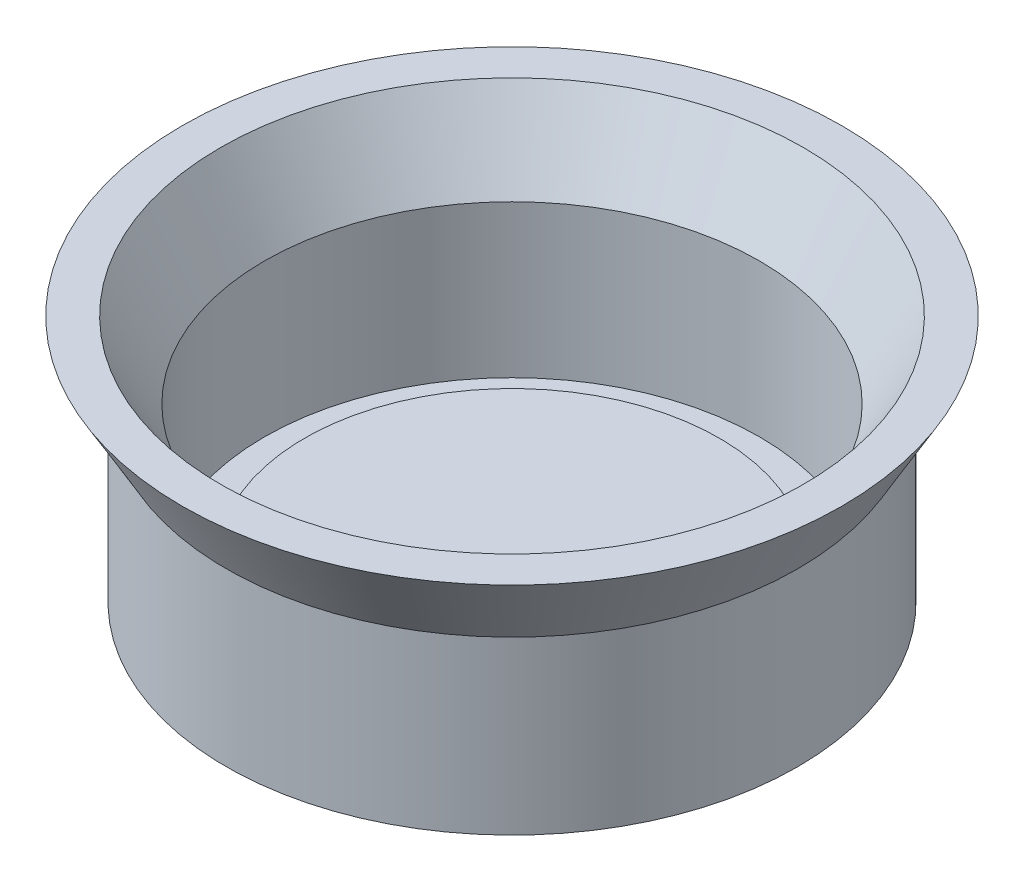
ISO-10303-21;
HEADER;
FILE_DESCRIPTION(('STEP AP214'),'2;1');
FILE_NAME('part.step','',(''),(''),'','','');
FILE_SCHEMA(('AUTOMOTIVE_DESIGN { 1 0 10303 214 1 1 1 1 }'));
ENDSEC;
DATA;
#1=APPLICATION_CONTEXT('core data for automotive mechanical design processes');
#2=APPLICATION_PROTOCOL_DEFINITION('international standard','automotive_design',2000,#1);
#3=PRODUCT_CONTEXT('',#1,'mechanical');
#4=PRODUCT('Part','Part','',(#3));
#5=PRODUCT_RELATED_PRODUCT_CATEGORY('part','',(#4));
#6=PRODUCT_DEFINITION_FORMATION('','',#4);
#7=PRODUCT_DEFINITION_CONTEXT('part definition',#1,'design');
#8=PRODUCT_DEFINITION('design','',#6,#7);
#9=PRODUCT_DEFINITION_SHAPE('','',#8);
#10=(LENGTH_UNIT() NAMED_UNIT(*) SI_UNIT(.MILLI.,.METRE.));
#11=(NAMED_UNIT(*) PLANE_ANGLE_UNIT() SI_UNIT($,.RADIAN.));
#12=(NAMED_UNIT(*) SI_UNIT($,.STERADIAN.) SOLID_ANGLE_UNIT());
#13=UNCERTAINTY_MEASURE_WITH_UNIT(LENGTH_MEASURE(1.E-05),#10,'distance_accuracy_value','');
#14=(GEOMETRIC_REPRESENTATION_CONTEXT(3) GLOBAL_UNCERTAINTY_ASSIGNED_CONTEXT((#13)) GLOBAL_UNIT_ASSIGNED_CONTEXT((#10,
#11,#12)) REPRESENTATION_CONTEXT('',''));
#15=CARTESIAN_POINT('',(0.,0.,0.));
#16=DIRECTION('',(0.,0.,1.));
#17=DIRECTION('',(1.,0.,0.));
#18=AXIS2_PLACEMENT_3D('',#15,#16,#17);
#19=CARTESIAN_POINT('',(0.,45.,0.));
#20=DIRECTION('',(0.,-1.,0.));
#21=DIRECTION('',(-1.,0.,0.));
#22=AXIS2_PLACEMENT_3D('',#19,#20,#21);
#23=CYLINDRICAL_SURFACE('',#22,65.);
#24=CARTESIAN_POINT('',(0.,45.,0.));
#25=DIRECTION('',(0.,-1.,0.));
#26=DIRECTION('',(0.,0.,-1.));
#27=AXIS2_PLACEMENT_3D('',#24,#25,#26);
#28=CIRCLE('',#27,65.);
#29=CARTESIAN_POINT('',(-65.,45.,0.));
#30=VERTEX_POINT('',#29);
#31=EDGE_CURVE('E75',#30,#30,#28,.T.);
#32=CARTESIAN_POINT('',(0.,5.,0.));
#33=DIRECTION('',(0.,1.,0.));
#34=DIRECTION('',(1.,0.,0.));
#35=AXIS2_PLACEMENT_3D('',#32,#33,#34);
#36=CIRCLE('',#35,65.);
#37=CARTESIAN_POINT('',(-65.,5.,0.));
#38=VERTEX_POINT('',#37);
#39=EDGE_CURVE('E66',#38,#38,#36,.T.);
#40=CARTESIAN_POINT('',(-65.,45.,0.));
#41=CARTESIAN_POINT('',(-65.,44.5833333333333,0.));
#42=CARTESIAN_POINT('',(-65.,44.1666666666667,0.));
#43=CARTESIAN_POINT('',(-65.,43.3333333333333,0.));
#44=CARTESIAN_POINT('',(-65.,42.9166666666667,0.));
#45=CARTESIAN_POINT('',(-65.,42.0833333333333,0.));
#46=CARTESIAN_POINT('',(-65.,41.6666666666667,0.));
#47=CARTESIAN_POINT('',(-65.,40.8333333333333,0.));
#48=CARTESIAN_POINT('',(-65.,40.4166666666667,0.));
#49=CARTESIAN_POINT('',(-65.,39.5833333333333,0.));
#50=CARTESIAN_POINT('',(-65.,39.1666666666667,0.));
#51=CARTESIAN_POINT('',(-65.,38.3333333333333,0.));
#52=CARTESIAN_POINT('',(-65.,37.9166666666667,0.));
#53=CARTESIAN_POINT('',(-65.,37.0833333333333,0.));
#54=CARTESIAN_POINT('',(-65.,36.6666666666667,0.));
#55=CARTESIAN_POINT('',(-65.,35.8333333333333,0.));
#56=CARTESIAN_POINT('',(-65.,35.4166666666667,0.));
#57=CARTESIAN_POINT('',(-65.,34.5833333333333,0.));
#58=CARTESIAN_POINT('',(-65.,34.1666666666667,0.));
#59=CARTESIAN_POINT('',(-65.,33.3333333333333,0.));
#60=CARTESIAN_POINT('',(-65.,32.9166666666667,0.));
#61=CARTESIAN_POINT('',(-65.,32.0833333333333,0.));
#62=CARTESIAN_POINT('',(-65.,31.6666666666667,0.));
#63=CARTESIAN_POINT('',(-65.,30.8333333333333,0.));
#64=CARTESIAN_POINT('',(-65.,30.4166666666667,0.));
#65=CARTESIAN_POINT('',(-65.,29.5833333333333,0.));
#66=CARTESIAN_POINT('',(-65.,29.1666666666667,0.));
#67=CARTESIAN_POINT('',(-65.,28.3333333333333,0.));
#68=CARTESIAN_POINT('',(-65.,27.9166666666667,0.));
#69=CARTESIAN_POINT('',(-65.,27.0833333333333,0.));
#70=CARTESIAN_POINT('',(-65.,26.6666666666667,0.));
#71=CARTESIAN_POINT('',(-65.,25.8333333333333,0.));
#72=CARTESIAN_POINT('',(-65.,25.4166666666667,0.));
#73=CARTESIAN_POINT('',(-65.,24.5833333333333,0.));
#74=CARTESIAN_POINT('',(-65.,24.1666666666667,0.));
#75=CARTESIAN_POINT('',(-65.,23.3333333333333,0.));
#76=CARTESIAN_POINT('',(-65.,22.9166666666667,0.));
#77=CARTESIAN_POINT('',(-65.,22.0833333333333,0.));
#78=CARTESIAN_POINT('',(-65.,21.6666666666667,0.));
#79=CARTESIAN_POINT('',(-65.,20.8333333333333,0.));
#80=CARTESIAN_POINT('',(-65.,20.4166666666667,0.));
#81=CARTESIAN_POINT('',(-65.,19.5833333333333,0.));
#82=CARTESIAN_POINT('',(-65.,19.1666666666667,0.));
#83=CARTESIAN_POINT('',(-65.,18.3333333333333,0.));
#84=CARTESIAN_POINT('',(-65.,17.9166666666667,0.));
#85=CARTESIAN_POINT('',(-65.,17.0833333333333,0.));
#86=CARTESIAN_POINT('',(-65.,16.6666666666667,0.));
#87=CARTESIAN_POINT('',(-65.,15.8333333333333,0.));
#88=CARTESIAN_POINT('',(-65.,15.4166666666667,0.));
#89=CARTESIAN_POINT('',(-65.,14.5833333333333,0.));
#90=CARTESIAN_POINT('',(-65.,14.1666666666667,0.));
#91=CARTESIAN_POINT('',(-65.,13.3333333333333,0.));
#92=CARTESIAN_POINT('',(-65.,12.9166666666667,0.));
#93=CARTESIAN_POINT('',(-65.,12.0833333333333,0.));
#94=CARTESIAN_POINT('',(-65.,11.6666666666667,0.));
#95=CARTESIAN_POINT('',(-65.,10.8333333333333,0.));
#96=CARTESIAN_POINT('',(-65.,10.4166666666667,0.));
#97=CARTESIAN_POINT('',(-65.,9.58333333333333,0.));
#98=CARTESIAN_POINT('',(-65.,9.16666666666666,0.));
#99=CARTESIAN_POINT('',(-65.,8.33333333333333,0.));
#100=CARTESIAN_POINT('',(-65.,7.91666666666667,0.));
#101=CARTESIAN_POINT('',(-65.,7.08333333333333,0.));
#102=CARTESIAN_POINT('',(-65.,6.66666666666667,0.));
#103=CARTESIAN_POINT('',(-65.,5.83333333333333,0.));
#104=CARTESIAN_POINT('',(-65.,5.41666666666667,0.));
#105=CARTESIAN_POINT('',(-65.,5.,0.));
#106=B_SPLINE_CURVE_WITH_KNOTS('',3,(#40,#41,#42,#43,#44,#45,#46,#47,#48,#49,#50,#51,#52,#53,
#54,#55,#56,#57,#58,#59,#60,#61,#62,#63,#64,#65,#66,#67,#68,#69,#70,#71,#72,#73,#74,#75,#76,#77,
#78,#79,#80,#81,#82,#83,#84,#85,#86,#87,#88,#89,#90,#91,#92,#93,#94,#95,#96,#97,#98,#99,#100,
#101,#102,#103,#104,#105),.UNSPECIFIED.,.F.,.F.,(4,2,2,2,2,2,2,2,2,2,2,2,2,2,2,2,2,2,2,2,2,2,2,
2,2,2,2,2,2,2,2,2,4),(0.,1.25,2.5,3.75,5.,6.25000000000001,7.5,8.75,10.,11.25,12.5,13.75,15.,
16.25,17.5,18.75,20.,21.25,22.5,23.75,25.,26.25,27.5,28.75,30.,31.25,32.5,33.75,35.,36.25,37.5,
38.75,40.),.UNSPECIFIED.);
#107=EDGE_CURVE('BSEAM53',#30,#38,#106,.T.);
#108=ORIENTED_EDGE('',*,*,#31,.F.);
#109=ORIENTED_EDGE('',*,*,#39,.F.);
#110=ORIENTED_EDGE('',*,*,#107,.T.);
#111=ORIENTED_EDGE('',*,*,#107,.F.);
#112=EDGE_LOOP('',(#108,#110,#109,#111));
#113=FACE_BOUND('',#112,.T.);
#114=ADVANCED_FACE('F53',(#113),#23,.F.);
#115=CARTESIAN_POINT('',(0.,5.,0.));
#116=DIRECTION('',(0.,1.,0.));
#117=DIRECTION('',(1.,0.,0.));
#118=AXIS2_PLACEMENT_3D('',#115,#116,#117);
#119=PLANE('',#118);
#120=ORIENTED_EDGE('',*,*,#39,.T.);
#121=EDGE_LOOP('',(#120));
#122=FACE_BOUND('',#121,.T.);
#123=ADVANCED_FACE('F89',(#122),#119,.T.);
#124=CARTESIAN_POINT('',(-86.5470053837925,65.,0.));
#125=DIRECTION('',(0.,1.,0.));
#126=DIRECTION('',(0.,0.,1.));
#127=AXIS2_PLACEMENT_3D('',#124,#125,#126);
#128=PLANE('',#127);
#129=CARTESIAN_POINT('',(0.,65.,0.));
#130=DIRECTION('',(0.,-1.,0.));
#131=DIRECTION('',(0.,0.,-1.));
#132=AXIS2_PLACEMENT_3D('',#129,#130,#131);
#133=CIRCLE('',#132,76.5470053837925);
#134=CARTESIAN_POINT('',(0.,65.,-76.5470053837925));
#135=VERTEX_POINT('',#134);
#136=EDGE_CURVE('E71',#135,#135,#133,.T.);
#137=ORIENTED_EDGE('',*,*,#136,.T.);
#138=EDGE_LOOP('',(#137));
#139=FACE_BOUND('',#138,.T.);
#140=CARTESIAN_POINT('',(0.,65.,0.));
#141=DIRECTION('',(0.,-1.,0.));
#142=DIRECTION('',(0.,0.,-1.));
#143=AXIS2_PLACEMENT_3D('',#140,#141,#142);
#144=CIRCLE('',#143,86.5470053837925);
#145=CARTESIAN_POINT('',(0.,65.,-86.5470053837925));
#146=VERTEX_POINT('',#145);
#147=EDGE_CURVE('E79',#146,#146,#144,.T.);
#148=ORIENTED_EDGE('',*,*,#147,.F.);
#149=EDGE_LOOP('',(#148));
#150=FACE_BOUND('',#149,.T.);
#151=ADVANCED_FACE('F86',(#139,#150),#128,.T.);
#152=CARTESIAN_POINT('',(0.,65.,0.));
#153=DIRECTION('',(0.,1.,0.));
#154=DIRECTION('',(0.,0.,1.));
#155=AXIS2_PLACEMENT_3D('',#152,#153,#154);
#156=CONICAL_SURFACE('',#155,76.5470053837925,0.523598775598299);
#157=ORIENTED_EDGE('',*,*,#31,.T.);
#158=EDGE_LOOP('',(#157));
#159=FACE_BOUND('',#158,.T.);
#160=ORIENTED_EDGE('',*,*,#136,.F.);
#161=EDGE_LOOP('',(#160));
#162=FACE_BOUND('',#161,.T.);
#163=ADVANCED_FACE('F88',(#159,#162),#156,.F.);
#164=CARTESIAN_POINT('',(0.,45.,0.));
#165=DIRECTION('',(0.,1.,0.));
#166=DIRECTION('',(0.,0.,1.));
#167=AXIS2_PLACEMENT_3D('',#164,#165,#166);
#168=CONICAL_SURFACE('',#167,75.,0.523598775598299);
#169=ORIENTED_EDGE('',*,*,#147,.T.);
#170=EDGE_LOOP('',(#169));
#171=FACE_BOUND('',#170,.T.);
#172=CARTESIAN_POINT('',(0.,45.,0.));
#173=DIRECTION('',(0.,1.,0.));
#174=DIRECTION('',(1.,0.,0.));
#175=AXIS2_PLACEMENT_3D('',#172,#173,#174);
#176=CIRCLE('',#175,75.);
#177=CARTESIAN_POINT('',(-75.,45.,0.));
#178=VERTEX_POINT('',#177);
#179=EDGE_CURVE('E11',#178,#178,#176,.T.);
#180=ORIENTED_EDGE('',*,*,#179,.T.);
#181=EDGE_LOOP('',(#180));
#182=FACE_BOUND('',#181,.T.);
#183=ADVANCED_FACE('F84',(#171,#182),#168,.T.);
#184=CARTESIAN_POINT('',(0.,0.,0.));
#185=DIRECTION('',(0.,1.,0.));
#186=DIRECTION('',(1.,0.,0.));
#187=AXIS2_PLACEMENT_3D('',#184,#185,#186);
#188=PLANE('',#187);
#189=CARTESIAN_POINT('',(0.,0.,0.));
#190=DIRECTION('',(0.,1.,0.));
#191=DIRECTION('',(1.,0.,0.));
#192=AXIS2_PLACEMENT_3D('',#189,#190,#191);
#193=CIRCLE('',#192,75.);
#194=CARTESIAN_POINT('',(-75.,0.,0.));
#195=VERTEX_POINT('',#194);
#196=EDGE_CURVE('E57',#195,#195,#193,.T.);
#197=ORIENTED_EDGE('',*,*,#196,.F.);
#198=EDGE_LOOP('',(#197));
#199=FACE_BOUND('',#198,.T.);
#200=ADVANCED_FACE('F108',(#199),#188,.F.);
#201=CARTESIAN_POINT('',(0.,45.,0.));
#202=DIRECTION('',(0.,-1.,0.));
#203=DIRECTION('',(-1.,0.,0.));
#204=AXIS2_PLACEMENT_3D('',#201,#202,#203);
#205=CYLINDRICAL_SURFACE('',#204,75.);
#206=CARTESIAN_POINT('',(-75.,45.,0.));
#207=CARTESIAN_POINT('',(-75.,44.53125,0.));
#208=CARTESIAN_POINT('',(-75.,44.0625,0.));
#209=CARTESIAN_POINT('',(-75.,43.125,0.));
#210=CARTESIAN_POINT('',(-75.,42.65625,0.));
#211=CARTESIAN_POINT('',(-75.,41.71875,0.));
#212=CARTESIAN_POINT('',(-75.,41.25,0.));
#213=CARTESIAN_POINT('',(-75.,40.3125,0.));
#214=CARTESIAN_POINT('',(-75.,39.84375,0.));
#215=CARTESIAN_POINT('',(-75.,38.90625,0.));
#216=CARTESIAN_POINT('',(-75.,38.4375,0.));
#217=CARTESIAN_POINT('',(-75.,37.5,0.));
#218=CARTESIAN_POINT('',(-75.,37.03125,0.));
#219=CARTESIAN_POINT('',(-75.,36.09375,0.));
#220=CARTESIAN_POINT('',(-75.,35.625,0.));
#221=CARTESIAN_POINT('',(-75.,34.6875,0.));
#222=CARTESIAN_POINT('',(-75.,34.21875,0.));
#223=CARTESIAN_POINT('',(-75.,33.28125,0.));
#224=CARTESIAN_POINT('',(-75.,32.8125,0.));
#225=CARTESIAN_POINT('',(-75.,31.875,0.));
#226=CARTESIAN_POINT('',(-75.,31.40625,0.));
#227=CARTESIAN_POINT('',(-75.,30.46875,0.));
#228=CARTESIAN_POINT('',(-75.,30.,0.));
#229=CARTESIAN_POINT('',(-75.,29.0625,0.));
#230=CARTESIAN_POINT('',(-75.,28.59375,0.));
#231=CARTESIAN_POINT('',(-75.,27.65625,0.));
#232=CARTESIAN_POINT('',(-75.,27.1875,0.));
#233=CARTESIAN_POINT('',(-75.,26.25,0.));
#234=CARTESIAN_POINT('',(-75.,25.78125,0.));
#235=CARTESIAN_POINT('',(-75.,24.84375,0.));
#236=CARTESIAN_POINT('',(-75.,24.375,0.));
#237=CARTESIAN_POINT('',(-75.,23.4375,0.));
#238=CARTESIAN_POINT('',(-75.,22.96875,0.));
#239=CARTESIAN_POINT('',(-75.,22.03125,0.));
#240=CARTESIAN_POINT('',(-75.,21.5625,0.));
#241=CARTESIAN_POINT('',(-75.,20.625,0.));
#242=CARTESIAN_POINT('',(-75.,20.15625,0.));
#243=CARTESIAN_POINT('',(-75.,19.21875,0.));
#244=CARTESIAN_POINT('',(-75.,18.75,0.));
#245=CARTESIAN_POINT('',(-75.,17.8125,0.));
#246=CARTESIAN_POINT('',(-75.,17.34375,0.));
#247=CARTESIAN_POINT('',(-75.,16.40625,0.));
#248=CARTESIAN_POINT('',(-75.,15.9375,0.));
#249=CARTESIAN_POINT('',(-75.,15.,0.));
#250=CARTESIAN_POINT('',(-75.,14.53125,0.));
#251=CARTESIAN_POINT('',(-75.,13.59375,0.));
#252=CARTESIAN_POINT('',(-75.,13.125,0.));
#253=CARTESIAN_POINT('',(-75.,12.1875,0.));
#254=CARTESIAN_POINT('',(-75.,11.71875,0.));
#255=CARTESIAN_POINT('',(-75.,10.78125,0.));
#256=CARTESIAN_POINT('',(-75.,10.3125,0.));
#257=CARTESIAN_POINT('',(-75.,9.37499999999999,0.));
#258=CARTESIAN_POINT('',(-75.,8.90624999999999,0.));
#259=CARTESIAN_POINT('',(-75.,7.96874999999999,0.));
#260=CARTESIAN_POINT('',(-75.,7.5,0.));
#261=CARTESIAN_POINT('',(-75.,6.56249999999999,0.));
#262=CARTESIAN_POINT('',(-75.,6.09374999999999,0.));
#263=CARTESIAN_POINT('',(-75.,5.15624999999999,0.));
#264=CARTESIAN_POINT('',(-75.,4.68749999999999,0.));
#265=CARTESIAN_POINT('',(-75.,3.74999999999999,0.));
#266=CARTESIAN_POINT('',(-75.,3.28124999999999,0.));
#267=CARTESIAN_POINT('',(-75.,2.34374999999999,0.));
#268=CARTESIAN_POINT('',(-75.,1.87499999999999,0.));
#269=CARTESIAN_POINT('',(-75.,0.937499999999992,0.));
#270=CARTESIAN_POINT('',(-75.,0.468749999999993,0.));
#271=CARTESIAN_POINT('',(-75.,0.,0.));
#272=B_SPLINE_CURVE_WITH_KNOTS('',3,(#206,#207,#208,#209,#210,#211,#212,#213,#214,#215,#216,
#217,#218,#219,#220,#221,#222,#223,#224,#225,#226,#227,#228,#229,#230,#231,#232,#233,#234,#235,
#236,#237,#238,#239,#240,#241,#242,#243,#244,#245,#246,#247,#248,#249,#250,#251,#252,#253,#254,
#255,#256,#257,#258,#259,#260,#261,#262,#263,#264,#265,#266,#267,#268,#269,#270,#271),
.UNSPECIFIED.,.F.,.F.,(4,2,2,2,2,2,2,2,2,2,2,2,2,2,2,2,2,2,2,2,2,2,2,2,2,2,2,2,2,2,2,2,4),(0.,
1.40625,2.8125,4.21874999999999,5.625,7.03125,8.43749999999999,9.84375,11.25,12.65625,14.0625,
15.46875,16.875,18.28125,19.6875,21.09375,22.5,23.90625,25.3125,26.71875,28.125,29.53125,
30.9375,32.34375,33.75,35.15625,36.5625,37.96875,39.375,40.78125,42.1875,43.59375,45.),.UNSPECIFIED.);
#273=EDGE_CURVE('BSEAM55',#178,#195,#272,.T.);
#274=ORIENTED_EDGE('',*,*,#179,.F.);
#275=ORIENTED_EDGE('',*,*,#196,.T.);
#276=ORIENTED_EDGE('',*,*,#273,.T.);
#277=ORIENTED_EDGE('',*,*,#273,.F.);
#278=EDGE_LOOP('',(#274,#276,#275,#277));
#279=FACE_BOUND('',#278,.T.);
#280=ADVANCED_FACE('F55',(#279),#205,.T.);
#281=CLOSED_SHELL('',(#114,#123,#151,#163,#183,#200,#280));
#282=MANIFOLD_SOLID_BREP('B2',#281);
#283=CARTESIAN_POINT('',(0.,10.,0.));
#284=DIRECTION('',(0.,-1.,0.));
#285=DIRECTION('',(-1.,0.,0.));
#286=AXIS2_PLACEMENT_3D('',#283,#284,#285);
#287=CYLINDRICAL_SURFACE('',#286,54.4425);
#288=CARTESIAN_POINT('',(0.,10.,0.));
#289=DIRECTION('',(0.,1.,0.));
#290=DIRECTION('',(1.,0.,0.));
#291=AXIS2_PLACEMENT_3D('',#288,#289,#290);
#292=CIRCLE('',#291,54.4425);
#293=CARTESIAN_POINT('',(54.4425,10.,0.));
#294=VERTEX_POINT('',#293);
#295=EDGE_CURVE('E52',#294,#294,#292,.T.);
#296=ORIENTED_EDGE('',*,*,#295,.F.);
#297=EDGE_LOOP('',(#296));
#298=FACE_BOUND('',#297,.T.);
#299=CARTESIAN_POINT('',(0.,0.,0.));
#300=DIRECTION('',(0.,1.,0.));
#301=DIRECTION('',(1.,0.,0.));
#302=AXIS2_PLACEMENT_3D('',#299,#300,#301);
#303=CIRCLE('',#302,54.4425);
#304=CARTESIAN_POINT('',(54.4425,0.,0.));
#305=VERTEX_POINT('',#304);
#306=EDGE_CURVE('E163',#305,#305,#303,.T.);
#307=ORIENTED_EDGE('',*,*,#306,.T.);
#308=EDGE_LOOP('',(#307));
#309=FACE_BOUND('',#308,.T.);
#310=ADVANCED_FACE('F160',(#298,#309),#287,.T.);
#311=CARTESIAN_POINT('',(0.,10.,0.));
#312=DIRECTION('',(0.,1.,0.));
#313=DIRECTION('',(1.,0.,0.));
#314=AXIS2_PLACEMENT_3D('',#311,#312,#313);
#315=PLANE('',#314);
#316=ORIENTED_EDGE('',*,*,#295,.T.);
#317=EDGE_LOOP('',(#316));
#318=FACE_BOUND('',#317,.T.);
#319=ADVANCED_FACE('F175',(#318),#315,.T.);
#320=CARTESIAN_POINT('',(0.,0.,0.));
#321=DIRECTION('',(0.,1.,0.));
#322=DIRECTION('',(1.,0.,0.));
#323=AXIS2_PLACEMENT_3D('',#320,#321,#322);
#324=PLANE('',#323);
#325=ORIENTED_EDGE('',*,*,#306,.F.);
#326=EDGE_LOOP('',(#325));
#327=FACE_BOUND('',#326,.T.);
#328=ADVANCED_FACE('F173',(#327),#324,.F.);
#329=CLOSED_SHELL('',(#310,#319,#328));
#330=MANIFOLD_SOLID_BREP('B6',#329);
#331=ADVANCED_BREP_SHAPE_REPRESENTATION('',(#18,#282,#330),#14);
#332=SHAPE_DEFINITION_REPRESENTATION(#9,#331);
ENDSEC;
END-ISO-10303-21;
